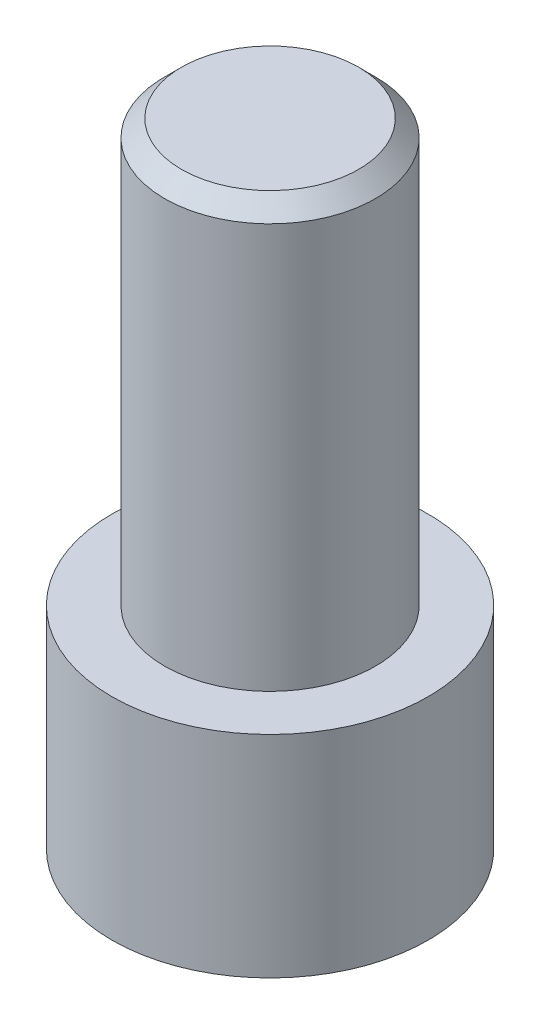
ISO-10303-21;
HEADER;
FILE_DESCRIPTION(('STEP AP214'),'2;1');
FILE_NAME('part.step','',(''),(''),'','','');
FILE_SCHEMA(('AUTOMOTIVE_DESIGN { 1 0 10303 214 1 1 1 1 }'));
ENDSEC;
DATA;
#1=APPLICATION_CONTEXT('core data for automotive mechanical design processes');
#2=APPLICATION_PROTOCOL_DEFINITION('international standard','automotive_design',2000,#1);
#3=PRODUCT_CONTEXT('',#1,'mechanical');
#4=PRODUCT('Part','Part','',(#3));
#5=PRODUCT_RELATED_PRODUCT_CATEGORY('part','',(#4));
#6=PRODUCT_DEFINITION_FORMATION('','',#4);
#7=PRODUCT_DEFINITION_CONTEXT('part definition',#1,'design');
#8=PRODUCT_DEFINITION('design','',#6,#7);
#9=PRODUCT_DEFINITION_SHAPE('','',#8);
#10=(LENGTH_UNIT() NAMED_UNIT(*) SI_UNIT(.MILLI.,.METRE.));
#11=(NAMED_UNIT(*) PLANE_ANGLE_UNIT() SI_UNIT($,.RADIAN.));
#12=(NAMED_UNIT(*) SI_UNIT($,.STERADIAN.) SOLID_ANGLE_UNIT());
#13=UNCERTAINTY_MEASURE_WITH_UNIT(LENGTH_MEASURE(1.E-05),#10,'distance_accuracy_value','');
#14=(GEOMETRIC_REPRESENTATION_CONTEXT(3) GLOBAL_UNCERTAINTY_ASSIGNED_CONTEXT((#13)) GLOBAL_UNIT_ASSIGNED_CONTEXT((#10,
#11,#12)) REPRESENTATION_CONTEXT('',''));
#15=CARTESIAN_POINT('',(0.,0.,0.));
#16=DIRECTION('',(0.,0.,1.));
#17=DIRECTION('',(1.,0.,0.));
#18=AXIS2_PLACEMENT_3D('',#15,#16,#17);
#19=CARTESIAN_POINT('',(0.,6.35,0.));
#20=DIRECTION('',(0.,-1.,0.));
#21=DIRECTION('',(0.,0.,-1.));
#22=AXIS2_PLACEMENT_3D('',#19,#20,#21);
#23=CYLINDRICAL_SURFACE('',#22,4.7625);
#24=CARTESIAN_POINT('',(0.,6.35,0.));
#25=DIRECTION('',(0.,1.,0.));
#26=DIRECTION('',(0.,0.,1.));
#27=AXIS2_PLACEMENT_3D('',#24,#25,#26);
#28=CIRCLE('',#27,4.7625);
#29=CARTESIAN_POINT('',(0.,6.35,4.7625));
#30=VERTEX_POINT('',#29);
#31=EDGE_CURVE('E171',#30,#30,#28,.T.);
#32=ORIENTED_EDGE('',*,*,#31,.F.);
#33=EDGE_LOOP('',(#32));
#34=FACE_BOUND('',#33,.T.);
#35=CARTESIAN_POINT('',(0.,0.,0.));
#36=DIRECTION('',(0.,1.,0.));
#37=DIRECTION('',(0.,0.,1.));
#38=AXIS2_PLACEMENT_3D('',#35,#36,#37);
#39=CIRCLE('',#38,4.7625);
#40=CARTESIAN_POINT('',(0.,0.,4.7625));
#41=VERTEX_POINT('',#40);
#42=EDGE_CURVE('E157',#41,#41,#39,.T.);
#43=ORIENTED_EDGE('',*,*,#42,.T.);
#44=EDGE_LOOP('',(#43));
#45=FACE_BOUND('',#44,.T.);
#46=ADVANCED_FACE('F41',(#34,#45),#23,.T.);
#47=CARTESIAN_POINT('',(0.,6.35,0.));
#48=DIRECTION('',(0.,1.,0.));
#49=DIRECTION('',(0.,0.,1.));
#50=AXIS2_PLACEMENT_3D('',#47,#48,#49);
#51=PLANE('',#50);
#52=CARTESIAN_POINT('',(0.,6.35,0.));
#53=DIRECTION('',(0.,1.,0.));
#54=DIRECTION('',(0.,0.,1.));
#55=AXIS2_PLACEMENT_3D('',#52,#53,#54);
#56=CIRCLE('',#55,3.175);
#57=CARTESIAN_POINT('',(0.,6.35,3.175));
#58=VERTEX_POINT('',#57);
#59=EDGE_CURVE('E167',#58,#58,#56,.T.);
#60=ORIENTED_EDGE('',*,*,#59,.F.);
#61=EDGE_LOOP('',(#60));
#62=FACE_BOUND('',#61,.T.);
#63=ORIENTED_EDGE('',*,*,#31,.T.);
#64=EDGE_LOOP('',(#63));
#65=FACE_BOUND('',#64,.T.);
#66=ADVANCED_FACE('F196',(#62,#65),#51,.T.);
#67=CARTESIAN_POINT('',(0.,0.,0.));
#68=DIRECTION('',(0.,1.,0.));
#69=DIRECTION('',(0.,0.,1.));
#70=AXIS2_PLACEMENT_3D('',#67,#68,#69);
#71=PLANE('',#70);
#72=DIRECTION('',(-1.,0.,0.));
#73=VECTOR('',#72,1.);
#74=CARTESIAN_POINT('',(1.27,0.,2.19970452561247));
#75=LINE('',#74,#73);
#76=CARTESIAN_POINT('',(1.27,0.,2.19970452561247));
#77=VERTEX_POINT('',#76);
#78=CARTESIAN_POINT('',(-1.27,0.,2.19970452561247));
#79=VERTEX_POINT('',#78);
#80=EDGE_CURVE('E138',#77,#79,#75,.T.);
#81=ORIENTED_EDGE('',*,*,#80,.F.);
#82=DIRECTION('',(-0.5,0.,0.866025403784439));
#83=VECTOR('',#82,1.);
#84=CARTESIAN_POINT('',(2.54,0.,0.));
#85=LINE('',#84,#83);
#86=CARTESIAN_POINT('',(2.54,0.,0.));
#87=VERTEX_POINT('',#86);
#88=EDGE_CURVE('E58',#87,#77,#85,.T.);
#89=ORIENTED_EDGE('',*,*,#88,.F.);
#90=DIRECTION('',(0.5,0.,0.866025403784439));
#91=VECTOR('',#90,1.);
#92=CARTESIAN_POINT('',(1.27,0.,-2.19970452561247));
#93=LINE('',#92,#91);
#94=CARTESIAN_POINT('',(1.27,0.,-2.19970452561247));
#95=VERTEX_POINT('',#94);
#96=EDGE_CURVE('E151',#95,#87,#93,.T.);
#97=ORIENTED_EDGE('',*,*,#96,.F.);
#98=DIRECTION('',(1.,0.,0.));
#99=VECTOR('',#98,1.);
#100=CARTESIAN_POINT('',(-1.27,0.,-2.19970452561247));
#101=LINE('',#100,#99);
#102=CARTESIAN_POINT('',(-1.27,0.,-2.19970452561247));
#103=VERTEX_POINT('',#102);
#104=EDGE_CURVE('E148',#103,#95,#101,.T.);
#105=ORIENTED_EDGE('',*,*,#104,.F.);
#106=DIRECTION('',(0.5,0.,-0.866025403784439));
#107=VECTOR('',#106,1.);
#108=CARTESIAN_POINT('',(-2.54,0.,0.));
#109=LINE('',#108,#107);
#110=CARTESIAN_POINT('',(-2.54,0.,0.));
#111=VERTEX_POINT('',#110);
#112=EDGE_CURVE('E106',#111,#103,#109,.T.);
#113=ORIENTED_EDGE('',*,*,#112,.F.);
#114=DIRECTION('',(-0.5,0.,-0.866025403784439));
#115=VECTOR('',#114,1.);
#116=CARTESIAN_POINT('',(-1.27,0.,2.19970452561247));
#117=LINE('',#116,#115);
#118=EDGE_CURVE('E142',#79,#111,#117,.T.);
#119=ORIENTED_EDGE('',*,*,#118,.F.);
#120=EDGE_LOOP('',(#81,#89,#97,#105,#113,#119));
#121=FACE_BOUND('',#120,.T.);
#122=ORIENTED_EDGE('',*,*,#42,.F.);
#123=EDGE_LOOP('',(#122));
#124=FACE_BOUND('',#123,.T.);
#125=ADVANCED_FACE('F201',(#121,#124),#71,.F.);
#126=CARTESIAN_POINT('',(0.,19.05,0.));
#127=DIRECTION('',(0.,-1.,0.));
#128=DIRECTION('',(0.,0.,-1.));
#129=AXIS2_PLACEMENT_3D('',#126,#127,#128);
#130=CYLINDRICAL_SURFACE('',#129,3.175);
#131=CARTESIAN_POINT('',(0.,18.542,0.));
#132=DIRECTION('',(0.,1.,0.));
#133=DIRECTION('',(0.,0.,1.));
#134=AXIS2_PLACEMENT_3D('',#131,#132,#133);
#135=CIRCLE('',#134,3.175);
#136=CARTESIAN_POINT('',(0.,18.542,3.175));
#137=VERTEX_POINT('',#136);
#138=EDGE_CURVE('E11',#137,#137,#135,.F.);
#139=ORIENTED_EDGE('',*,*,#138,.T.);
#140=EDGE_LOOP('',(#139));
#141=FACE_BOUND('',#140,.T.);
#142=ORIENTED_EDGE('',*,*,#59,.T.);
#143=EDGE_LOOP('',(#142));
#144=FACE_BOUND('',#143,.T.);
#145=ADVANCED_FACE('F192',(#141,#144),#130,.T.);
#146=CARTESIAN_POINT('',(0.,19.05,0.));
#147=DIRECTION('',(0.,1.,0.));
#148=DIRECTION('',(0.,0.,1.));
#149=AXIS2_PLACEMENT_3D('',#146,#147,#148);
#150=PLANE('',#149);
#151=CARTESIAN_POINT('',(0.,19.05,0.));
#152=DIRECTION('',(0.,1.,0.));
#153=DIRECTION('',(0.,0.,1.));
#154=AXIS2_PLACEMENT_3D('',#151,#152,#153);
#155=CIRCLE('',#154,2.667);
#156=CARTESIAN_POINT('',(0.,19.05,2.667));
#157=VERTEX_POINT('',#156);
#158=EDGE_CURVE('E51',#157,#157,#155,.T.);
#159=ORIENTED_EDGE('',*,*,#158,.T.);
#160=EDGE_LOOP('',(#159));
#161=FACE_BOUND('',#160,.T.);
#162=ADVANCED_FACE('F181',(#161),#150,.T.);
#163=CARTESIAN_POINT('',(0.,19.05,0.));
#164=DIRECTION('',(0.,-1.,0.));
#165=DIRECTION('',(0.,0.,-1.));
#166=AXIS2_PLACEMENT_3D('',#163,#164,#165);
#167=CONICAL_SURFACE('',#166,2.667,0.785398163397444);
#168=ORIENTED_EDGE('',*,*,#138,.F.);
#169=EDGE_LOOP('',(#168));
#170=FACE_BOUND('',#169,.T.);
#171=ORIENTED_EDGE('',*,*,#158,.F.);
#172=EDGE_LOOP('',(#171));
#173=FACE_BOUND('',#172,.T.);
#174=ADVANCED_FACE('F44',(#170,#173),#167,.T.);
#175=CARTESIAN_POINT('',(2.54,3.81,0.));
#176=DIRECTION('',(0.866025403784439,0.,0.5));
#177=DIRECTION('',(0.5,0.,-0.866025403784439));
#178=AXIS2_PLACEMENT_3D('',#175,#176,#177);
#179=PLANE('',#178);
#180=ORIENTED_EDGE('',*,*,#88,.T.);
#181=DIRECTION('',(0.,-1.,0.));
#182=VECTOR('',#181,1.);
#183=CARTESIAN_POINT('',(1.27,3.81,2.19970452561247));
#184=LINE('',#183,#182);
#185=CARTESIAN_POINT('',(1.27,3.81,2.19970452561247));
#186=VERTEX_POINT('',#185);
#187=EDGE_CURVE('E88',#186,#77,#184,.T.);
#188=ORIENTED_EDGE('',*,*,#187,.F.);
#189=DIRECTION('',(-0.5,0.,0.866025403784439));
#190=VECTOR('',#189,1.);
#191=CARTESIAN_POINT('',(2.54,3.81,0.));
#192=LINE('',#191,#190);
#193=CARTESIAN_POINT('',(2.54,3.81,0.));
#194=VERTEX_POINT('',#193);
#195=EDGE_CURVE('E154',#194,#186,#192,.T.);
#196=ORIENTED_EDGE('',*,*,#195,.F.);
#197=DIRECTION('',(0.,-1.,0.));
#198=VECTOR('',#197,1.);
#199=CARTESIAN_POINT('',(2.54,3.81,0.));
#200=LINE('',#199,#198);
#201=EDGE_CURVE('E66',#194,#87,#200,.T.);
#202=ORIENTED_EDGE('',*,*,#201,.T.);
#203=EDGE_LOOP('',(#180,#188,#196,#202));
#204=FACE_BOUND('',#203,.T.);
#205=ADVANCED_FACE('F184',(#204),#179,.F.);
#206=CARTESIAN_POINT('',(1.27,3.81,-2.19970452561247));
#207=DIRECTION('',(0.866025403784439,0.,-0.5));
#208=DIRECTION('',(-0.5,0.,-0.866025403784439));
#209=AXIS2_PLACEMENT_3D('',#206,#207,#208);
#210=PLANE('',#209);
#211=ORIENTED_EDGE('',*,*,#96,.T.);
#212=ORIENTED_EDGE('',*,*,#201,.F.);
#213=DIRECTION('',(0.5,0.,0.866025403784439));
#214=VECTOR('',#213,1.);
#215=CARTESIAN_POINT('',(1.27,3.81,-2.19970452561247));
#216=LINE('',#215,#214);
#217=CARTESIAN_POINT('',(1.27,3.81,-2.19970452561247));
#218=VERTEX_POINT('',#217);
#219=EDGE_CURVE('E120',#218,#194,#216,.T.);
#220=ORIENTED_EDGE('',*,*,#219,.F.);
#221=DIRECTION('',(0.,-1.,0.));
#222=VECTOR('',#221,1.);
#223=CARTESIAN_POINT('',(1.27,3.81,-2.19970452561247));
#224=LINE('',#223,#222);
#225=EDGE_CURVE('E111',#218,#95,#224,.T.);
#226=ORIENTED_EDGE('',*,*,#225,.T.);
#227=EDGE_LOOP('',(#211,#212,#220,#226));
#228=FACE_BOUND('',#227,.T.);
#229=ADVANCED_FACE('F190',(#228),#210,.F.);
#230=CARTESIAN_POINT('',(-1.27,3.81,-2.19970452561247));
#231=DIRECTION('',(0.,0.,-1.));
#232=DIRECTION('',(-1.,0.,0.));
#233=AXIS2_PLACEMENT_3D('',#230,#231,#232);
#234=PLANE('',#233);
#235=ORIENTED_EDGE('',*,*,#104,.T.);
#236=ORIENTED_EDGE('',*,*,#225,.F.);
#237=DIRECTION('',(1.,0.,0.));
#238=VECTOR('',#237,1.);
#239=CARTESIAN_POINT('',(-1.27,3.81,-2.19970452561247));
#240=LINE('',#239,#238);
#241=CARTESIAN_POINT('',(-1.27,3.81,-2.19970452561247));
#242=VERTEX_POINT('',#241);
#243=EDGE_CURVE('E115',#242,#218,#240,.T.);
#244=ORIENTED_EDGE('',*,*,#243,.F.);
#245=DIRECTION('',(0.,-1.,0.));
#246=VECTOR('',#245,1.);
#247=CARTESIAN_POINT('',(-1.27,3.81,-2.19970452561247));
#248=LINE('',#247,#246);
#249=EDGE_CURVE('E99',#242,#103,#248,.T.);
#250=ORIENTED_EDGE('',*,*,#249,.T.);
#251=EDGE_LOOP('',(#235,#236,#244,#250));
#252=FACE_BOUND('',#251,.T.);
#253=ADVANCED_FACE('F116',(#252),#234,.F.);
#254=CARTESIAN_POINT('',(-2.54,3.81,0.));
#255=DIRECTION('',(-0.866025403784439,0.,-0.5));
#256=DIRECTION('',(-0.5,0.,0.866025403784439));
#257=AXIS2_PLACEMENT_3D('',#254,#255,#256);
#258=PLANE('',#257);
#259=ORIENTED_EDGE('',*,*,#112,.T.);
#260=ORIENTED_EDGE('',*,*,#249,.F.);
#261=DIRECTION('',(0.5,0.,-0.866025403784439));
#262=VECTOR('',#261,1.);
#263=CARTESIAN_POINT('',(-2.54,3.81,0.));
#264=LINE('',#263,#262);
#265=CARTESIAN_POINT('',(-2.54,3.81,0.));
#266=VERTEX_POINT('',#265);
#267=EDGE_CURVE('E103',#266,#242,#264,.T.);
#268=ORIENTED_EDGE('',*,*,#267,.F.);
#269=DIRECTION('',(0.,-1.,0.));
#270=VECTOR('',#269,1.);
#271=CARTESIAN_POINT('',(-2.54,3.81,0.));
#272=LINE('',#271,#270);
#273=EDGE_CURVE('E112',#266,#111,#272,.T.);
#274=ORIENTED_EDGE('',*,*,#273,.T.);
#275=EDGE_LOOP('',(#259,#260,#268,#274));
#276=FACE_BOUND('',#275,.T.);
#277=ADVANCED_FACE('F101',(#276),#258,.F.);
#278=CARTESIAN_POINT('',(-1.27,3.81,2.19970452561247));
#279=DIRECTION('',(-0.866025403784439,0.,0.5));
#280=DIRECTION('',(0.5,0.,0.866025403784439));
#281=AXIS2_PLACEMENT_3D('',#278,#279,#280);
#282=PLANE('',#281);
#283=ORIENTED_EDGE('',*,*,#118,.T.);
#284=ORIENTED_EDGE('',*,*,#273,.F.);
#285=DIRECTION('',(-0.5,0.,-0.866025403784439));
#286=VECTOR('',#285,1.);
#287=CARTESIAN_POINT('',(-1.27,3.81,2.19970452561247));
#288=LINE('',#287,#286);
#289=CARTESIAN_POINT('',(-1.27,3.81,2.19970452561247));
#290=VERTEX_POINT('',#289);
#291=EDGE_CURVE('E126',#290,#266,#288,.T.);
#292=ORIENTED_EDGE('',*,*,#291,.F.);
#293=DIRECTION('',(0.,-1.,0.));
#294=VECTOR('',#293,1.);
#295=CARTESIAN_POINT('',(-1.27,3.81,2.19970452561247));
#296=LINE('',#295,#294);
#297=EDGE_CURVE('E162',#290,#79,#296,.T.);
#298=ORIENTED_EDGE('',*,*,#297,.T.);
#299=EDGE_LOOP('',(#283,#284,#292,#298));
#300=FACE_BOUND('',#299,.T.);
#301=ADVANCED_FACE('F216',(#300),#282,.F.);
#302=CARTESIAN_POINT('',(1.27,3.81,2.19970452561247));
#303=DIRECTION('',(0.,0.,1.));
#304=DIRECTION('',(1.,0.,0.));
#305=AXIS2_PLACEMENT_3D('',#302,#303,#304);
#306=PLANE('',#305);
#307=ORIENTED_EDGE('',*,*,#80,.T.);
#308=ORIENTED_EDGE('',*,*,#297,.F.);
#309=DIRECTION('',(-1.,0.,0.));
#310=VECTOR('',#309,1.);
#311=CARTESIAN_POINT('',(1.27,3.81,2.19970452561247));
#312=LINE('',#311,#310);
#313=EDGE_CURVE('E130',#186,#290,#312,.T.);
#314=ORIENTED_EDGE('',*,*,#313,.F.);
#315=ORIENTED_EDGE('',*,*,#187,.T.);
#316=EDGE_LOOP('',(#307,#308,#314,#315));
#317=FACE_BOUND('',#316,.T.);
#318=ADVANCED_FACE('F213',(#317),#306,.F.);
#319=CARTESIAN_POINT('',(0.,3.81,0.));
#320=DIRECTION('',(0.,-1.,0.));
#321=DIRECTION('',(0.,0.,-1.));
#322=AXIS2_PLACEMENT_3D('',#319,#320,#321);
#323=PLANE('',#322);
#324=ORIENTED_EDGE('',*,*,#195,.T.);
#325=ORIENTED_EDGE('',*,*,#313,.T.);
#326=ORIENTED_EDGE('',*,*,#291,.T.);
#327=ORIENTED_EDGE('',*,*,#267,.T.);
#328=ORIENTED_EDGE('',*,*,#243,.T.);
#329=ORIENTED_EDGE('',*,*,#219,.T.);
#330=EDGE_LOOP('',(#324,#325,#326,#327,#328,#329));
#331=FACE_BOUND('',#330,.T.);
#332=ADVANCED_FACE('F123',(#331),#323,.T.);
#333=CLOSED_SHELL('',(#46,#66,#125,#145,#162,#174,#205,#229,#253,#277,#301,#318,#332));
#334=MANIFOLD_SOLID_BREP('B2',#333);
#335=ADVANCED_BREP_SHAPE_REPRESENTATION('',(#18,#334),#14);
#336=SHAPE_DEFINITION_REPRESENTATION(#9,#335);
ENDSEC;
END-ISO-10303-21;
